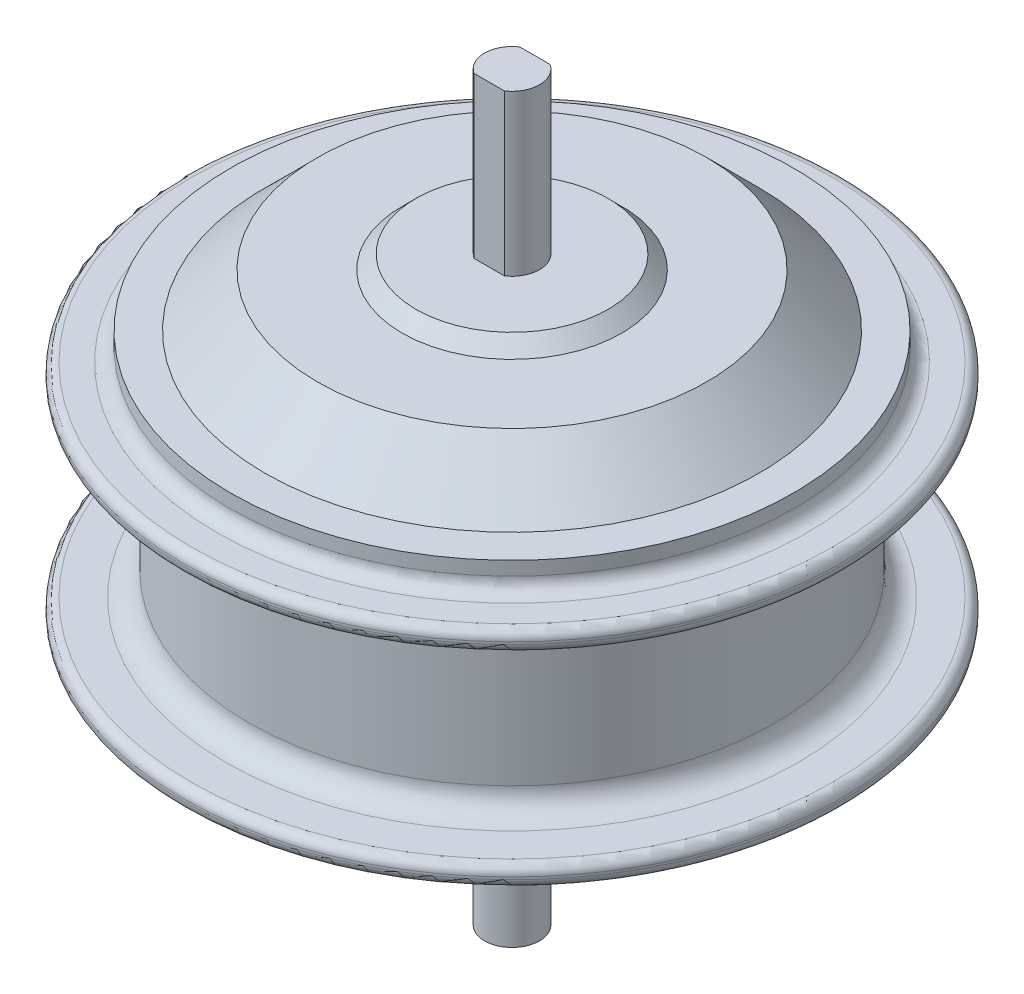
ISO-10303-21;
HEADER;
FILE_DESCRIPTION(('STEP AP214'),'2;1');
FILE_NAME('part.step','',(''),(''),'','','');
FILE_SCHEMA(('AUTOMOTIVE_DESIGN { 1 0 10303 214 1 1 1 1 }'));
ENDSEC;
DATA;
#1=APPLICATION_CONTEXT('core data for automotive mechanical design processes');
#2=APPLICATION_PROTOCOL_DEFINITION('international standard','automotive_design',2000,#1);
#3=PRODUCT_CONTEXT('',#1,'mechanical');
#4=PRODUCT('Part','Part','',(#3));
#5=PRODUCT_RELATED_PRODUCT_CATEGORY('part','',(#4));
#6=PRODUCT_DEFINITION_FORMATION('','',#4);
#7=PRODUCT_DEFINITION_CONTEXT('part definition',#1,'design');
#8=PRODUCT_DEFINITION('design','',#6,#7);
#9=PRODUCT_DEFINITION_SHAPE('','',#8);
#10=(LENGTH_UNIT() NAMED_UNIT(*) SI_UNIT(.MILLI.,.METRE.));
#11=(NAMED_UNIT(*) PLANE_ANGLE_UNIT() SI_UNIT($,.RADIAN.));
#12=(NAMED_UNIT(*) SI_UNIT($,.STERADIAN.) SOLID_ANGLE_UNIT());
#13=UNCERTAINTY_MEASURE_WITH_UNIT(LENGTH_MEASURE(1.E-05),#10,'distance_accuracy_value','');
#14=(GEOMETRIC_REPRESENTATION_CONTEXT(3) GLOBAL_UNCERTAINTY_ASSIGNED_CONTEXT((#13)) GLOBAL_UNIT_ASSIGNED_CONTEXT((#10,
#11,#12)) REPRESENTATION_CONTEXT('',''));
#15=CARTESIAN_POINT('',(0.,0.,0.));
#16=DIRECTION('',(0.,0.,1.));
#17=DIRECTION('',(1.,0.,0.));
#18=AXIS2_PLACEMENT_3D('',#15,#16,#17);
#19=CARTESIAN_POINT('',(0.,80.,0.));
#20=DIRECTION('',(0.,1.,0.));
#21=DIRECTION('',(0.,0.,1.));
#22=AXIS2_PLACEMENT_3D('',#19,#20,#21);
#23=CYLINDRICAL_SURFACE('',#22,6.);
#24=DIRECTION('',(0.,1.,0.));
#25=VECTOR('',#24,1.);
#26=CARTESIAN_POINT('',(3.3166247903554,38.2917960675007,-5.));
#27=LINE('',#26,#25);
#28=CARTESIAN_POINT('',(3.31662479035539,45.,-5.));
#29=VERTEX_POINT('',#28);
#30=CARTESIAN_POINT('',(3.3166247903554,80.,-5.));
#31=VERTEX_POINT('',#30);
#32=EDGE_CURVE('E88',#29,#31,#27,.T.);
#33=ORIENTED_EDGE('',*,*,#32,.T.);
#34=CARTESIAN_POINT('',(0.,80.,0.));
#35=DIRECTION('',(0.,1.,0.));
#36=DIRECTION('',(0.,0.,1.));
#37=AXIS2_PLACEMENT_3D('',#34,#35,#36);
#38=CIRCLE('',#37,6.);
#39=CARTESIAN_POINT('',(3.3166247903554,80.,5.));
#40=VERTEX_POINT('',#39);
#41=EDGE_CURVE('E97',#40,#31,#38,.T.);
#42=ORIENTED_EDGE('',*,*,#41,.F.);
#43=DIRECTION('',(0.,1.,0.));
#44=VECTOR('',#43,1.);
#45=CARTESIAN_POINT('',(3.3166247903554,38.2917960675007,5.));
#46=LINE('',#45,#44);
#47=CARTESIAN_POINT('',(3.3166247903554,45.,5.));
#48=VERTEX_POINT('',#47);
#49=EDGE_CURVE('E586',#48,#40,#46,.T.);
#50=ORIENTED_EDGE('',*,*,#49,.F.);
#51=CARTESIAN_POINT('',(0.,45.,0.));
#52=DIRECTION('',(0.,1.,0.));
#53=DIRECTION('',(0.,0.,1.));
#54=AXIS2_PLACEMENT_3D('',#51,#52,#53);
#55=CIRCLE('',#54,6.);
#56=EDGE_CURVE('E104',#48,#29,#55,.T.);
#57=ORIENTED_EDGE('',*,*,#56,.T.);
#58=EDGE_LOOP('',(#33,#42,#50,#57));
#59=FACE_BOUND('',#58,.T.);
#60=ADVANCED_FACE('F39',(#59),#23,.T.);
#61=CARTESIAN_POINT('',(0.,80.,0.));
#62=DIRECTION('',(0.,1.,0.));
#63=DIRECTION('',(0.,0.,1.));
#64=AXIS2_PLACEMENT_3D('',#61,#62,#63);
#65=PLANE('',#64);
#66=DIRECTION('',(1.,0.,0.));
#67=VECTOR('',#66,1.);
#68=CARTESIAN_POINT('',(-3.3166247903554,80.,-5.));
#69=LINE('',#68,#67);
#70=CARTESIAN_POINT('',(-3.3166247903554,80.,-5.));
#71=VERTEX_POINT('',#70);
#72=EDGE_CURVE('E82',#71,#31,#69,.T.);
#73=ORIENTED_EDGE('',*,*,#72,.F.);
#74=CARTESIAN_POINT('',(-3.3166247903554,80.,5.));
#75=VERTEX_POINT('',#74);
#76=EDGE_CURVE('E95',#71,#75,#38,.T.);
#77=ORIENTED_EDGE('',*,*,#76,.T.);
#78=DIRECTION('',(-1.,0.,0.));
#79=VECTOR('',#78,1.);
#80=CARTESIAN_POINT('',(-3.3166247903554,80.,5.));
#81=LINE('',#80,#79);
#82=EDGE_CURVE('E588',#40,#75,#81,.T.);
#83=ORIENTED_EDGE('',*,*,#82,.F.);
#84=ORIENTED_EDGE('',*,*,#41,.T.);
#85=EDGE_LOOP('',(#73,#77,#83,#84));
#86=FACE_BOUND('',#85,.T.);
#87=ADVANCED_FACE('F93',(#86),#65,.T.);
#88=DIRECTION('',(0.,1.,0.));
#89=VECTOR('',#88,1.);
#90=CARTESIAN_POINT('',(-3.3166247903554,38.2917960675007,-5.));
#91=LINE('',#90,#89);
#92=CARTESIAN_POINT('',(-3.3166247903554,45.,-5.));
#93=VERTEX_POINT('',#92);
#94=EDGE_CURVE('E79',#93,#71,#91,.T.);
#95=ORIENTED_EDGE('',*,*,#94,.F.);
#96=CARTESIAN_POINT('',(-3.31662479035539,45.,5.));
#97=VERTEX_POINT('',#96);
#98=EDGE_CURVE('E110',#93,#97,#55,.T.);
#99=ORIENTED_EDGE('',*,*,#98,.T.);
#100=DIRECTION('',(0.,1.,0.));
#101=VECTOR('',#100,1.);
#102=CARTESIAN_POINT('',(-3.3166247903554,38.2917960675007,5.));
#103=LINE('',#102,#101);
#104=EDGE_CURVE('E102',#97,#75,#103,.T.);
#105=ORIENTED_EDGE('',*,*,#104,.T.);
#106=ORIENTED_EDGE('',*,*,#76,.F.);
#107=EDGE_LOOP('',(#95,#99,#105,#106));
#108=FACE_BOUND('',#107,.T.);
#109=ADVANCED_FACE('F101',(#108),#23,.T.);
#110=CARTESIAN_POINT('',(0.,45.,6.));
#111=DIRECTION('',(0.,1.,0.));
#112=DIRECTION('',(0.,0.,1.));
#113=AXIS2_PLACEMENT_3D('',#110,#111,#112);
#114=PLANE('',#113);
#115=CARTESIAN_POINT('',(0.,45.,0.));
#116=DIRECTION('',(0.,1.,0.));
#117=DIRECTION('',(0.,0.,1.));
#118=AXIS2_PLACEMENT_3D('',#115,#116,#117);
#119=CIRCLE('',#118,21.);
#120=CARTESIAN_POINT('',(0.,45.,21.));
#121=VERTEX_POINT('',#120);
#122=EDGE_CURVE('E581',#121,#121,#119,.T.);
#123=ORIENTED_EDGE('',*,*,#122,.T.);
#124=EDGE_LOOP('',(#123));
#125=FACE_BOUND('',#124,.T.);
#126=ORIENTED_EDGE('',*,*,#56,.F.);
#127=DIRECTION('',(1.,0.,0.));
#128=VECTOR('',#127,1.);
#129=CARTESIAN_POINT('',(-3.3166247903554,45.,5.));
#130=LINE('',#129,#128);
#131=EDGE_CURVE('E55',#97,#48,#130,.T.);
#132=ORIENTED_EDGE('',*,*,#131,.F.);
#133=ORIENTED_EDGE('',*,*,#98,.F.);
#134=DIRECTION('',(-1.,0.,0.));
#135=VECTOR('',#134,1.);
#136=CARTESIAN_POINT('',(-3.3166247903554,45.,-5.));
#137=LINE('',#136,#135);
#138=EDGE_CURVE('E60',#29,#93,#137,.T.);
#139=ORIENTED_EDGE('',*,*,#138,.F.);
#140=EDGE_LOOP('',(#126,#132,#133,#139));
#141=FACE_BOUND('',#140,.T.);
#142=ADVANCED_FACE('F197',(#125,#141),#114,.T.);
#143=CARTESIAN_POINT('',(0.,45.,0.));
#144=DIRECTION('',(0.,-1.,0.));
#145=DIRECTION('',(0.,0.,-1.));
#146=AXIS2_PLACEMENT_3D('',#143,#144,#145);
#147=CONICAL_SURFACE('',#146,21.,0.78539816339745);
#148=CARTESIAN_POINT('',(0.,42.,0.));
#149=DIRECTION('',(0.,1.,0.));
#150=DIRECTION('',(0.,0.,1.));
#151=AXIS2_PLACEMENT_3D('',#148,#149,#150);
#152=CIRCLE('',#151,24.);
#153=CARTESIAN_POINT('',(0.,42.,24.));
#154=VERTEX_POINT('',#153);
#155=EDGE_CURVE('E578',#154,#154,#152,.T.);
#156=ORIENTED_EDGE('',*,*,#155,.T.);
#157=EDGE_LOOP('',(#156));
#158=FACE_BOUND('',#157,.T.);
#159=ORIENTED_EDGE('',*,*,#122,.F.);
#160=EDGE_LOOP('',(#159));
#161=FACE_BOUND('',#160,.T.);
#162=ADVANCED_FACE('F201',(#158,#161),#147,.T.);
#163=CARTESIAN_POINT('',(0.,42.,24.));
#164=DIRECTION('',(0.,1.,0.));
#165=DIRECTION('',(0.,0.,1.));
#166=AXIS2_PLACEMENT_3D('',#163,#164,#165);
#167=PLANE('',#166);
#168=CARTESIAN_POINT('',(0.,42.,0.));
#169=DIRECTION('',(0.,1.,0.));
#170=DIRECTION('',(0.,0.,1.));
#171=AXIS2_PLACEMENT_3D('',#168,#169,#170);
#172=CIRCLE('',#171,42.5);
#173=CARTESIAN_POINT('',(0.,42.,42.5));
#174=VERTEX_POINT('',#173);
#175=EDGE_CURVE('E574',#174,#174,#172,.T.);
#176=ORIENTED_EDGE('',*,*,#175,.T.);
#177=EDGE_LOOP('',(#176));
#178=FACE_BOUND('',#177,.T.);
#179=ORIENTED_EDGE('',*,*,#155,.F.);
#180=EDGE_LOOP('',(#179));
#181=FACE_BOUND('',#180,.T.);
#182=ADVANCED_FACE('F206',(#178,#181),#167,.T.);
#183=CARTESIAN_POINT('',(0.,42.,0.));
#184=DIRECTION('',(0.,-1.,0.));
#185=DIRECTION('',(0.,0.,-1.));
#186=AXIS2_PLACEMENT_3D('',#183,#184,#185);
#187=CONICAL_SURFACE('',#186,42.5,0.785398163397528);
#188=CARTESIAN_POINT('',(0.,30.5000000000018,0.));
#189=DIRECTION('',(0.,1.,0.));
#190=DIRECTION('',(0.,0.,1.));
#191=AXIS2_PLACEMENT_3D('',#188,#189,#190);
#192=CIRCLE('',#191,54.);
#193=CARTESIAN_POINT('',(0.,30.5000000000018,54.));
#194=VERTEX_POINT('',#193);
#195=EDGE_CURVE('E570',#194,#194,#192,.T.);
#196=ORIENTED_EDGE('',*,*,#195,.T.);
#197=EDGE_LOOP('',(#196));
#198=FACE_BOUND('',#197,.T.);
#199=ORIENTED_EDGE('',*,*,#175,.F.);
#200=EDGE_LOOP('',(#199));
#201=FACE_BOUND('',#200,.T.);
#202=ADVANCED_FACE('F213',(#198,#201),#187,.T.);
#203=CARTESIAN_POINT('',(0.,30.5000000000009,54.));
#204=DIRECTION('',(0.,1.,0.));
#205=DIRECTION('',(0.,0.,1.));
#206=AXIS2_PLACEMENT_3D('',#203,#204,#205);
#207=PLANE('',#206);
#208=CARTESIAN_POINT('',(0.,30.5,0.));
#209=DIRECTION('',(0.,1.,0.));
#210=DIRECTION('',(0.,0.,1.));
#211=AXIS2_PLACEMENT_3D('',#208,#209,#210);
#212=CIRCLE('',#211,61.5);
#213=CARTESIAN_POINT('',(0.,30.5,61.5));
#214=VERTEX_POINT('',#213);
#215=EDGE_CURVE('E566',#214,#214,#212,.T.);
#216=ORIENTED_EDGE('',*,*,#215,.T.);
#217=EDGE_LOOP('',(#216));
#218=FACE_BOUND('',#217,.T.);
#219=ORIENTED_EDGE('',*,*,#195,.F.);
#220=EDGE_LOOP('',(#219));
#221=FACE_BOUND('',#220,.T.);
#222=ADVANCED_FACE('F217',(#218,#221),#207,.T.);
#223=CARTESIAN_POINT('',(0.,80.,0.));
#224=DIRECTION('',(0.,1.,0.));
#225=DIRECTION('',(0.,0.,1.));
#226=AXIS2_PLACEMENT_3D('',#223,#224,#225);
#227=CYLINDRICAL_SURFACE('',#226,61.5);
#228=CARTESIAN_POINT('',(0.,27.5,0.));
#229=DIRECTION('',(0.,1.,0.));
#230=DIRECTION('',(0.,0.,1.));
#231=AXIS2_PLACEMENT_3D('',#228,#229,#230);
#232=CIRCLE('',#231,61.5);
#233=CARTESIAN_POINT('',(0.,27.5,61.5));
#234=VERTEX_POINT('',#233);
#235=EDGE_CURVE('E48',#234,#234,#232,.T.);
#236=ORIENTED_EDGE('',*,*,#235,.T.);
#237=EDGE_LOOP('',(#236));
#238=FACE_BOUND('',#237,.T.);
#239=ORIENTED_EDGE('',*,*,#215,.F.);
#240=EDGE_LOOP('',(#239));
#241=FACE_BOUND('',#240,.T.);
#242=ADVANCED_FACE('F172',(#238,#241),#227,.T.);
#243=CARTESIAN_POINT('',(0.,24.5,61.5));
#244=DIRECTION('',(0.,1.,0.));
#245=DIRECTION('',(0.,0.,1.));
#246=AXIS2_PLACEMENT_3D('',#243,#244,#245);
#247=PLANE('',#246);
#248=CARTESIAN_POINT('',(0.,24.5,0.));
#249=DIRECTION('',(0.,1.,0.));
#250=DIRECTION('',(0.,0.,1.));
#251=AXIS2_PLACEMENT_3D('',#248,#249,#250);
#252=CIRCLE('',#251,64.5);
#253=CARTESIAN_POINT('',(0.,24.5,64.5));
#254=VERTEX_POINT('',#253);
#255=EDGE_CURVE('E11',#254,#254,#252,.F.);
#256=ORIENTED_EDGE('',*,*,#255,.T.);
#257=EDGE_LOOP('',(#256));
#258=FACE_BOUND('',#257,.T.);
#259=CARTESIAN_POINT('',(0.,24.5,0.));
#260=DIRECTION('',(0.,1.,0.));
#261=DIRECTION('',(0.,0.,1.));
#262=AXIS2_PLACEMENT_3D('',#259,#260,#261);
#263=CIRCLE('',#262,70.);
#264=CARTESIAN_POINT('',(0.,24.5,70.));
#265=VERTEX_POINT('',#264);
#266=EDGE_CURVE('E141',#265,#265,#263,.T.);
#267=ORIENTED_EDGE('',*,*,#266,.T.);
#268=EDGE_LOOP('',(#267));
#269=FACE_BOUND('',#268,.T.);
#270=ADVANCED_FACE('F224',(#258,#269),#247,.T.);
#271=CARTESIAN_POINT('',(0.,80.,0.));
#272=DIRECTION('',(0.,1.,0.));
#273=DIRECTION('',(0.,0.,1.));
#274=AXIS2_PLACEMENT_3D('',#271,#272,#273);
#275=CYLINDRICAL_SURFACE('',#274,72.);
#276=CARTESIAN_POINT('',(0.,22.,0.));
#277=DIRECTION('',(0.,-1.,0.));
#278=DIRECTION('',(0.,0.,-1.));
#279=AXIS2_PLACEMENT_3D('',#276,#277,#278);
#280=CIRCLE('',#279,72.);
#281=CARTESIAN_POINT('',(0.,22.,-72.));
#282=VERTEX_POINT('',#281);
#283=EDGE_CURVE('E133',#282,#282,#280,.F.);
#284=ORIENTED_EDGE('',*,*,#283,.T.);
#285=EDGE_LOOP('',(#284));
#286=FACE_BOUND('',#285,.T.);
#287=CARTESIAN_POINT('',(0.,22.5,0.));
#288=DIRECTION('',(0.,1.,0.));
#289=DIRECTION('',(0.,0.,1.));
#290=AXIS2_PLACEMENT_3D('',#287,#288,#289);
#291=CIRCLE('',#290,72.);
#292=CARTESIAN_POINT('',(0.,22.5,72.));
#293=VERTEX_POINT('',#292);
#294=EDGE_CURVE('E129',#293,#293,#291,.F.);
#295=ORIENTED_EDGE('',*,*,#294,.T.);
#296=EDGE_LOOP('',(#295));
#297=FACE_BOUND('',#296,.T.);
#298=ADVANCED_FACE('F227',(#286,#297),#275,.T.);
#299=CARTESIAN_POINT('',(0.,20.,72.));
#300=DIRECTION('',(0.,-1.,0.));
#301=DIRECTION('',(0.,0.,-1.));
#302=AXIS2_PLACEMENT_3D('',#299,#300,#301);
#303=PLANE('',#302);
#304=CARTESIAN_POINT('',(0.,20.,0.));
#305=DIRECTION('',(0.,-1.,0.));
#306=DIRECTION('',(0.,0.,-1.));
#307=AXIS2_PLACEMENT_3D('',#304,#305,#306);
#308=CIRCLE('',#307,62.5);
#309=CARTESIAN_POINT('',(0.,20.,-62.5));
#310=VERTEX_POINT('',#309);
#311=EDGE_CURVE('E145',#310,#310,#308,.F.);
#312=ORIENTED_EDGE('',*,*,#311,.T.);
#313=EDGE_LOOP('',(#312));
#314=FACE_BOUND('',#313,.T.);
#315=CARTESIAN_POINT('',(0.,20.,0.));
#316=DIRECTION('',(0.,-1.,0.));
#317=DIRECTION('',(0.,0.,-1.));
#318=AXIS2_PLACEMENT_3D('',#315,#316,#317);
#319=CIRCLE('',#318,70.);
#320=CARTESIAN_POINT('',(0.,20.,-70.));
#321=VERTEX_POINT('',#320);
#322=EDGE_CURVE('E137',#321,#321,#319,.T.);
#323=ORIENTED_EDGE('',*,*,#322,.T.);
#324=EDGE_LOOP('',(#323));
#325=FACE_BOUND('',#324,.T.);
#326=ADVANCED_FACE('F231',(#314,#325),#303,.T.);
#327=CARTESIAN_POINT('',(0.,80.,0.));
#328=DIRECTION('',(0.,1.,0.));
#329=DIRECTION('',(0.,0.,1.));
#330=AXIS2_PLACEMENT_3D('',#327,#328,#329);
#331=CYLINDRICAL_SURFACE('',#330,57.5);
#332=CARTESIAN_POINT('',(0.,15.,0.));
#333=DIRECTION('',(0.,-1.,0.));
#334=DIRECTION('',(0.,0.,-1.));
#335=AXIS2_PLACEMENT_3D('',#332,#333,#334);
#336=CIRCLE('',#335,57.5);
#337=CARTESIAN_POINT('',(0.,15.,-57.5));
#338=VERTEX_POINT('',#337);
#339=EDGE_CURVE('E153',#338,#338,#336,.T.);
#340=ORIENTED_EDGE('',*,*,#339,.T.);
#341=EDGE_LOOP('',(#340));
#342=FACE_BOUND('',#341,.T.);
#343=CARTESIAN_POINT('',(0.,-15.,0.));
#344=DIRECTION('',(0.,1.,0.));
#345=DIRECTION('',(0.,0.,1.));
#346=AXIS2_PLACEMENT_3D('',#343,#344,#345);
#347=CIRCLE('',#346,57.5);
#348=CARTESIAN_POINT('',(0.,-15.,57.5));
#349=VERTEX_POINT('',#348);
#350=EDGE_CURVE('E149',#349,#349,#347,.T.);
#351=ORIENTED_EDGE('',*,*,#350,.T.);
#352=EDGE_LOOP('',(#351));
#353=FACE_BOUND('',#352,.T.);
#354=ADVANCED_FACE('F235',(#342,#353),#331,.T.);
#355=CARTESIAN_POINT('',(0.,-20.,57.5));
#356=DIRECTION('',(0.,1.,0.));
#357=DIRECTION('',(0.,0.,1.));
#358=AXIS2_PLACEMENT_3D('',#355,#356,#357);
#359=PLANE('',#358);
#360=CARTESIAN_POINT('',(0.,-20.,0.));
#361=DIRECTION('',(0.,1.,0.));
#362=DIRECTION('',(0.,0.,1.));
#363=AXIS2_PLACEMENT_3D('',#360,#361,#362);
#364=CIRCLE('',#363,62.5);
#365=CARTESIAN_POINT('',(0.,-20.,62.5));
#366=VERTEX_POINT('',#365);
#367=EDGE_CURVE('E157',#366,#366,#364,.F.);
#368=ORIENTED_EDGE('',*,*,#367,.T.);
#369=EDGE_LOOP('',(#368));
#370=FACE_BOUND('',#369,.T.);
#371=CARTESIAN_POINT('',(0.,-20.,0.));
#372=DIRECTION('',(0.,1.,0.));
#373=DIRECTION('',(0.,0.,1.));
#374=AXIS2_PLACEMENT_3D('',#371,#372,#373);
#375=CIRCLE('',#374,70.);
#376=CARTESIAN_POINT('',(0.,-20.,70.));
#377=VERTEX_POINT('',#376);
#378=EDGE_CURVE('E125',#377,#377,#375,.T.);
#379=ORIENTED_EDGE('',*,*,#378,.T.);
#380=EDGE_LOOP('',(#379));
#381=FACE_BOUND('',#380,.T.);
#382=ADVANCED_FACE('F239',(#370,#381),#359,.T.);
#383=CARTESIAN_POINT('',(0.,80.,0.));
#384=DIRECTION('',(0.,1.,0.));
#385=DIRECTION('',(0.,0.,1.));
#386=AXIS2_PLACEMENT_3D('',#383,#384,#385);
#387=CYLINDRICAL_SURFACE('',#386,72.);
#388=CARTESIAN_POINT('',(0.,-22.5,0.));
#389=DIRECTION('',(0.,-1.,0.));
#390=DIRECTION('',(0.,0.,-1.));
#391=AXIS2_PLACEMENT_3D('',#388,#389,#390);
#392=CIRCLE('',#391,72.);
#393=CARTESIAN_POINT('',(0.,-22.5,-72.));
#394=VERTEX_POINT('',#393);
#395=EDGE_CURVE('E117',#394,#394,#392,.F.);
#396=ORIENTED_EDGE('',*,*,#395,.T.);
#397=EDGE_LOOP('',(#396));
#398=FACE_BOUND('',#397,.T.);
#399=CARTESIAN_POINT('',(0.,-22.,0.));
#400=DIRECTION('',(0.,1.,0.));
#401=DIRECTION('',(0.,0.,1.));
#402=AXIS2_PLACEMENT_3D('',#399,#400,#401);
#403=CIRCLE('',#402,72.);
#404=CARTESIAN_POINT('',(0.,-22.,72.));
#405=VERTEX_POINT('',#404);
#406=EDGE_CURVE('E108',#405,#405,#403,.F.);
#407=ORIENTED_EDGE('',*,*,#406,.T.);
#408=EDGE_LOOP('',(#407));
#409=FACE_BOUND('',#408,.T.);
#410=ADVANCED_FACE('F243',(#398,#409),#387,.T.);
#411=CARTESIAN_POINT('',(0.,-24.5,72.));
#412=DIRECTION('',(0.,-1.,0.));
#413=DIRECTION('',(0.,0.,-1.));
#414=AXIS2_PLACEMENT_3D('',#411,#412,#413);
#415=PLANE('',#414);
#416=CARTESIAN_POINT('',(0.,-24.5,0.));
#417=DIRECTION('',(0.,-1.,0.));
#418=DIRECTION('',(0.,0.,-1.));
#419=AXIS2_PLACEMENT_3D('',#416,#417,#418);
#420=CIRCLE('',#419,64.5);
#421=CARTESIAN_POINT('',(0.,-24.5,-64.5));
#422=VERTEX_POINT('',#421);
#423=EDGE_CURVE('E161',#422,#422,#420,.F.);
#424=ORIENTED_EDGE('',*,*,#423,.T.);
#425=EDGE_LOOP('',(#424));
#426=FACE_BOUND('',#425,.T.);
#427=CARTESIAN_POINT('',(0.,-24.5,0.));
#428=DIRECTION('',(0.,-1.,0.));
#429=DIRECTION('',(0.,0.,-1.));
#430=AXIS2_PLACEMENT_3D('',#427,#428,#429);
#431=CIRCLE('',#430,70.);
#432=CARTESIAN_POINT('',(0.,-24.5,-70.));
#433=VERTEX_POINT('',#432);
#434=EDGE_CURVE('E121',#433,#433,#431,.T.);
#435=ORIENTED_EDGE('',*,*,#434,.T.);
#436=EDGE_LOOP('',(#435));
#437=FACE_BOUND('',#436,.T.);
#438=ADVANCED_FACE('F247',(#426,#437),#415,.T.);
#439=CARTESIAN_POINT('',(0.,80.,0.));
#440=DIRECTION('',(0.,1.,0.));
#441=DIRECTION('',(0.,0.,1.));
#442=AXIS2_PLACEMENT_3D('',#439,#440,#441);
#443=CYLINDRICAL_SURFACE('',#442,61.5);
#444=CARTESIAN_POINT('',(0.,-27.5,0.));
#445=DIRECTION('',(0.,-1.,0.));
#446=DIRECTION('',(0.,0.,-1.));
#447=AXIS2_PLACEMENT_3D('',#444,#445,#446);
#448=CIRCLE('',#447,61.5);
#449=CARTESIAN_POINT('',(0.,-27.5,-61.5));
#450=VERTEX_POINT('',#449);
#451=EDGE_CURVE('E165',#450,#450,#448,.T.);
#452=ORIENTED_EDGE('',*,*,#451,.T.);
#453=EDGE_LOOP('',(#452));
#454=FACE_BOUND('',#453,.T.);
#455=CARTESIAN_POINT('',(0.,-30.5,0.));
#456=DIRECTION('',(0.,1.,0.));
#457=DIRECTION('',(0.,0.,1.));
#458=AXIS2_PLACEMENT_3D('',#455,#456,#457);
#459=CIRCLE('',#458,61.5);
#460=CARTESIAN_POINT('',(0.,-30.5,61.5));
#461=VERTEX_POINT('',#460);
#462=EDGE_CURVE('E562',#461,#461,#459,.T.);
#463=ORIENTED_EDGE('',*,*,#462,.T.);
#464=EDGE_LOOP('',(#463));
#465=FACE_BOUND('',#464,.T.);
#466=ADVANCED_FACE('F251',(#454,#465),#443,.T.);
#467=CARTESIAN_POINT('',(0.,-30.5,61.5));
#468=DIRECTION('',(0.,-1.,0.));
#469=DIRECTION('',(0.,0.,-1.));
#470=AXIS2_PLACEMENT_3D('',#467,#468,#469);
#471=PLANE('',#470);
#472=CARTESIAN_POINT('',(0.,-30.5,0.));
#473=DIRECTION('',(0.,1.,0.));
#474=DIRECTION('',(0.,0.,1.));
#475=AXIS2_PLACEMENT_3D('',#472,#473,#474);
#476=CIRCLE('',#475,54.);
#477=CARTESIAN_POINT('',(0.,-30.5,54.));
#478=VERTEX_POINT('',#477);
#479=EDGE_CURVE('E558',#478,#478,#476,.T.);
#480=ORIENTED_EDGE('',*,*,#479,.T.);
#481=EDGE_LOOP('',(#480));
#482=FACE_BOUND('',#481,.T.);
#483=ORIENTED_EDGE('',*,*,#462,.F.);
#484=EDGE_LOOP('',(#483));
#485=FACE_BOUND('',#484,.T.);
#486=ADVANCED_FACE('F255',(#482,#485),#471,.T.);
#487=CARTESIAN_POINT('',(0.,-30.5,0.));
#488=DIRECTION('',(0.,1.,0.));
#489=DIRECTION('',(0.,0.,1.));
#490=AXIS2_PLACEMENT_3D('',#487,#488,#489);
#491=CONICAL_SURFACE('',#490,54.,0.785398163397451);
#492=CARTESIAN_POINT('',(0.,-41.9999999999999,0.));
#493=DIRECTION('',(0.,1.,0.));
#494=DIRECTION('',(0.,0.,1.));
#495=AXIS2_PLACEMENT_3D('',#492,#493,#494);
#496=CIRCLE('',#495,42.5);
#497=CARTESIAN_POINT('',(0.,-41.9999999999999,42.5));
#498=VERTEX_POINT('',#497);
#499=EDGE_CURVE('E554',#498,#498,#496,.T.);
#500=ORIENTED_EDGE('',*,*,#499,.T.);
#501=EDGE_LOOP('',(#500));
#502=FACE_BOUND('',#501,.T.);
#503=ORIENTED_EDGE('',*,*,#479,.F.);
#504=EDGE_LOOP('',(#503));
#505=FACE_BOUND('',#504,.T.);
#506=ADVANCED_FACE('F259',(#502,#505),#491,.T.);
#507=CARTESIAN_POINT('',(0.,-41.9999999999999,42.5));
#508=DIRECTION('',(0.,-1.,0.));
#509=DIRECTION('',(0.,0.,-1.));
#510=AXIS2_PLACEMENT_3D('',#507,#508,#509);
#511=PLANE('',#510);
#512=CARTESIAN_POINT('',(0.,-42.,0.));
#513=DIRECTION('',(0.,1.,0.));
#514=DIRECTION('',(0.,0.,1.));
#515=AXIS2_PLACEMENT_3D('',#512,#513,#514);
#516=CIRCLE('',#515,26.6500000000033);
#517=CARTESIAN_POINT('',(0.,-42.,26.6500000000033));
#518=VERTEX_POINT('',#517);
#519=EDGE_CURVE('E550',#518,#518,#516,.T.);
#520=ORIENTED_EDGE('',*,*,#519,.T.);
#521=EDGE_LOOP('',(#520));
#522=FACE_BOUND('',#521,.T.);
#523=ORIENTED_EDGE('',*,*,#499,.F.);
#524=EDGE_LOOP('',(#523));
#525=FACE_BOUND('',#524,.T.);
#526=ADVANCED_FACE('F263',(#522,#525),#511,.T.);
#527=CARTESIAN_POINT('',(0.,80.,0.));
#528=DIRECTION('',(0.,1.,0.));
#529=DIRECTION('',(0.,0.,1.));
#530=AXIS2_PLACEMENT_3D('',#527,#528,#529);
#531=CYLINDRICAL_SURFACE('',#530,26.6500000000033);
#532=CARTESIAN_POINT('',(0.,-51.,0.));
#533=DIRECTION('',(0.,1.,0.));
#534=DIRECTION('',(0.,0.,1.));
#535=AXIS2_PLACEMENT_3D('',#532,#533,#534);
#536=CIRCLE('',#535,26.6500000000033);
#537=CARTESIAN_POINT('',(0.,-51.,26.6500000000033));
#538=VERTEX_POINT('',#537);
#539=EDGE_CURVE('E541',#538,#538,#536,.T.);
#540=ORIENTED_EDGE('',*,*,#539,.T.);
#541=EDGE_LOOP('',(#540));
#542=FACE_BOUND('',#541,.T.);
#543=ORIENTED_EDGE('',*,*,#519,.F.);
#544=EDGE_LOOP('',(#543));
#545=FACE_BOUND('',#544,.T.);
#546=ADVANCED_FACE('F267',(#542,#545),#531,.T.);
#547=CARTESIAN_POINT('',(0.,-51.,26.6500000000033));
#548=DIRECTION('',(0.,-1.,0.));
#549=DIRECTION('',(0.,0.,-1.));
#550=AXIS2_PLACEMENT_3D('',#547,#548,#549);
#551=PLANE('',#550);
#552=CARTESIAN_POINT('',(0.,-50.9999999999999,0.));
#553=DIRECTION('',(0.,1.,0.));
#554=DIRECTION('',(0.,0.,1.));
#555=AXIS2_PLACEMENT_3D('',#552,#553,#554);
#556=CIRCLE('',#555,5.99999999999999);
#557=CARTESIAN_POINT('',(0.,-50.9999999999999,5.99999999999999));
#558=VERTEX_POINT('',#557);
#559=EDGE_CURVE('E536',#558,#558,#556,.T.);
#560=ORIENTED_EDGE('',*,*,#559,.T.);
#561=EDGE_LOOP('',(#560));
#562=FACE_BOUND('',#561,.T.);
#563=ORIENTED_EDGE('',*,*,#539,.F.);
#564=EDGE_LOOP('',(#563));
#565=FACE_BOUND('',#564,.T.);
#566=ADVANCED_FACE('F271',(#562,#565),#551,.T.);
#567=CARTESIAN_POINT('',(0.,80.,0.));
#568=DIRECTION('',(0.,1.,0.));
#569=DIRECTION('',(0.,0.,1.));
#570=AXIS2_PLACEMENT_3D('',#567,#568,#569);
#571=CYLINDRICAL_SURFACE('',#570,5.99999999999998);
#572=CARTESIAN_POINT('',(0.,-81.9999999999999,0.));
#573=DIRECTION('',(0.,1.,0.));
#574=DIRECTION('',(0.,0.,1.));
#575=AXIS2_PLACEMENT_3D('',#572,#573,#574);
#576=CIRCLE('',#575,5.99999999999998);
#577=CARTESIAN_POINT('',(0.,-81.9999999999999,5.99999999999998));
#578=VERTEX_POINT('',#577);
#579=EDGE_CURVE('E534',#578,#578,#576,.T.);
#580=ORIENTED_EDGE('',*,*,#579,.T.);
#581=EDGE_LOOP('',(#580));
#582=FACE_BOUND('',#581,.T.);
#583=ORIENTED_EDGE('',*,*,#559,.F.);
#584=EDGE_LOOP('',(#583));
#585=FACE_BOUND('',#584,.T.);
#586=ADVANCED_FACE('F275',(#582,#585),#571,.T.);
#587=CARTESIAN_POINT('',(0.,-81.9999999999999,5.99999999999998));
#588=DIRECTION('',(0.,-1.,0.));
#589=DIRECTION('',(0.,0.,-1.));
#590=AXIS2_PLACEMENT_3D('',#587,#588,#589);
#591=PLANE('',#590);
#592=ORIENTED_EDGE('',*,*,#579,.F.);
#593=EDGE_LOOP('',(#592));
#594=FACE_BOUND('',#593,.T.);
#595=ADVANCED_FACE('F279',(#594),#591,.T.);
#596=CARTESIAN_POINT('',(0.,-22.5,0.));
#597=DIRECTION('',(0.,-1.,0.));
#598=DIRECTION('',(0.,0.,-1.));
#599=AXIS2_PLACEMENT_3D('',#596,#597,#598);
#600=TOROIDAL_SURFACE('',#599,70.,2.);
#601=ORIENTED_EDGE('',*,*,#434,.F.);
#602=EDGE_LOOP('',(#601));
#603=FACE_BOUND('',#602,.T.);
#604=ORIENTED_EDGE('',*,*,#395,.F.);
#605=EDGE_LOOP('',(#604));
#606=FACE_BOUND('',#605,.T.);
#607=ADVANCED_FACE('F282',(#603,#606),#600,.T.);
#608=CARTESIAN_POINT('',(0.,-22.,0.));
#609=DIRECTION('',(0.,1.,0.));
#610=DIRECTION('',(0.,0.,1.));
#611=AXIS2_PLACEMENT_3D('',#608,#609,#610);
#612=TOROIDAL_SURFACE('',#611,70.,2.);
#613=ORIENTED_EDGE('',*,*,#406,.F.);
#614=EDGE_LOOP('',(#613));
#615=FACE_BOUND('',#614,.T.);
#616=ORIENTED_EDGE('',*,*,#378,.F.);
#617=EDGE_LOOP('',(#616));
#618=FACE_BOUND('',#617,.T.);
#619=ADVANCED_FACE('F406',(#615,#618),#612,.T.);
#620=CARTESIAN_POINT('',(0.,22.,0.));
#621=DIRECTION('',(0.,-1.,0.));
#622=DIRECTION('',(0.,0.,-1.));
#623=AXIS2_PLACEMENT_3D('',#620,#621,#622);
#624=TOROIDAL_SURFACE('',#623,70.,2.);
#625=ORIENTED_EDGE('',*,*,#322,.F.);
#626=EDGE_LOOP('',(#625));
#627=FACE_BOUND('',#626,.T.);
#628=ORIENTED_EDGE('',*,*,#283,.F.);
#629=EDGE_LOOP('',(#628));
#630=FACE_BOUND('',#629,.T.);
#631=ADVANCED_FACE('F396',(#627,#630),#624,.T.);
#632=CARTESIAN_POINT('',(0.,22.5,0.));
#633=DIRECTION('',(0.,1.,0.));
#634=DIRECTION('',(0.,0.,1.));
#635=AXIS2_PLACEMENT_3D('',#632,#633,#634);
#636=TOROIDAL_SURFACE('',#635,70.,2.);
#637=ORIENTED_EDGE('',*,*,#294,.F.);
#638=EDGE_LOOP('',(#637));
#639=FACE_BOUND('',#638,.T.);
#640=ORIENTED_EDGE('',*,*,#266,.F.);
#641=EDGE_LOOP('',(#640));
#642=FACE_BOUND('',#641,.T.);
#643=ADVANCED_FACE('F368',(#639,#642),#636,.T.);
#644=CARTESIAN_POINT('',(0.,15.,0.));
#645=DIRECTION('',(0.,-1.,0.));
#646=DIRECTION('',(0.,0.,-1.));
#647=AXIS2_PLACEMENT_3D('',#644,#645,#646);
#648=TOROIDAL_SURFACE('',#647,62.5,5.);
#649=ORIENTED_EDGE('',*,*,#339,.F.);
#650=EDGE_LOOP('',(#649));
#651=FACE_BOUND('',#650,.T.);
#652=ORIENTED_EDGE('',*,*,#311,.F.);
#653=EDGE_LOOP('',(#652));
#654=FACE_BOUND('',#653,.T.);
#655=ADVANCED_FACE('F358',(#651,#654),#648,.F.);
#656=CARTESIAN_POINT('',(0.,-15.,0.));
#657=DIRECTION('',(0.,1.,0.));
#658=DIRECTION('',(0.,0.,1.));
#659=AXIS2_PLACEMENT_3D('',#656,#657,#658);
#660=TOROIDAL_SURFACE('',#659,62.5,5.);
#661=ORIENTED_EDGE('',*,*,#367,.F.);
#662=EDGE_LOOP('',(#661));
#663=FACE_BOUND('',#662,.T.);
#664=ORIENTED_EDGE('',*,*,#350,.F.);
#665=EDGE_LOOP('',(#664));
#666=FACE_BOUND('',#665,.T.);
#667=ADVANCED_FACE('F185',(#663,#666),#660,.F.);
#668=CARTESIAN_POINT('',(0.,-27.5,0.));
#669=DIRECTION('',(0.,-1.,0.));
#670=DIRECTION('',(0.,0.,-1.));
#671=AXIS2_PLACEMENT_3D('',#668,#669,#670);
#672=TOROIDAL_SURFACE('',#671,64.5,3.);
#673=ORIENTED_EDGE('',*,*,#451,.F.);
#674=EDGE_LOOP('',(#673));
#675=FACE_BOUND('',#674,.T.);
#676=ORIENTED_EDGE('',*,*,#423,.F.);
#677=EDGE_LOOP('',(#676));
#678=FACE_BOUND('',#677,.T.);
#679=ADVANCED_FACE('F177',(#675,#678),#672,.F.);
#680=CARTESIAN_POINT('',(0.,27.5,0.));
#681=DIRECTION('',(0.,1.,0.));
#682=DIRECTION('',(0.,0.,1.));
#683=AXIS2_PLACEMENT_3D('',#680,#681,#682);
#684=TOROIDAL_SURFACE('',#683,64.5,3.);
#685=ORIENTED_EDGE('',*,*,#255,.F.);
#686=EDGE_LOOP('',(#685));
#687=FACE_BOUND('',#686,.T.);
#688=ORIENTED_EDGE('',*,*,#235,.F.);
#689=EDGE_LOOP('',(#688));
#690=FACE_BOUND('',#689,.T.);
#691=ADVANCED_FACE('F41',(#687,#690),#684,.F.);
#692=CARTESIAN_POINT('',(-3.3166247903554,38.2917960675007,5.));
#693=DIRECTION('',(0.,0.,-1.));
#694=DIRECTION('',(-1.,0.,0.));
#695=AXIS2_PLACEMENT_3D('',#692,#693,#694);
#696=PLANE('',#695);
#697=ORIENTED_EDGE('',*,*,#131,.T.);
#698=ORIENTED_EDGE('',*,*,#49,.T.);
#699=ORIENTED_EDGE('',*,*,#82,.T.);
#700=ORIENTED_EDGE('',*,*,#104,.F.);
#701=EDGE_LOOP('',(#697,#698,#699,#700));
#702=FACE_BOUND('',#701,.T.);
#703=ADVANCED_FACE('F176',(#702),#696,.F.);
#704=CARTESIAN_POINT('',(-3.3166247903554,38.2917960675007,-5.));
#705=DIRECTION('',(0.,0.,1.));
#706=DIRECTION('',(1.,0.,0.));
#707=AXIS2_PLACEMENT_3D('',#704,#705,#706);
#708=PLANE('',#707);
#709=ORIENTED_EDGE('',*,*,#138,.T.);
#710=ORIENTED_EDGE('',*,*,#94,.T.);
#711=ORIENTED_EDGE('',*,*,#72,.T.);
#712=ORIENTED_EDGE('',*,*,#32,.F.);
#713=EDGE_LOOP('',(#709,#710,#711,#712));
#714=FACE_BOUND('',#713,.T.);
#715=ADVANCED_FACE('F81',(#714),#708,.F.);
#716=CLOSED_SHELL('',(#60,#87,#109,#142,#162,#182,#202,#222,#242,#270,#298,#326,#354,#382,#410,
#438,#466,#486,#506,#526,#546,#566,#586,#595,#607,#619,#631,#643,#655,#667,#679,#691,#703,#715));
#717=MANIFOLD_SOLID_BREP('B2',#716);
#718=ADVANCED_BREP_SHAPE_REPRESENTATION('',(#18,#717),#14);
#719=SHAPE_DEFINITION_REPRESENTATION(#9,#718);
ENDSEC;
END-ISO-10303-21;
